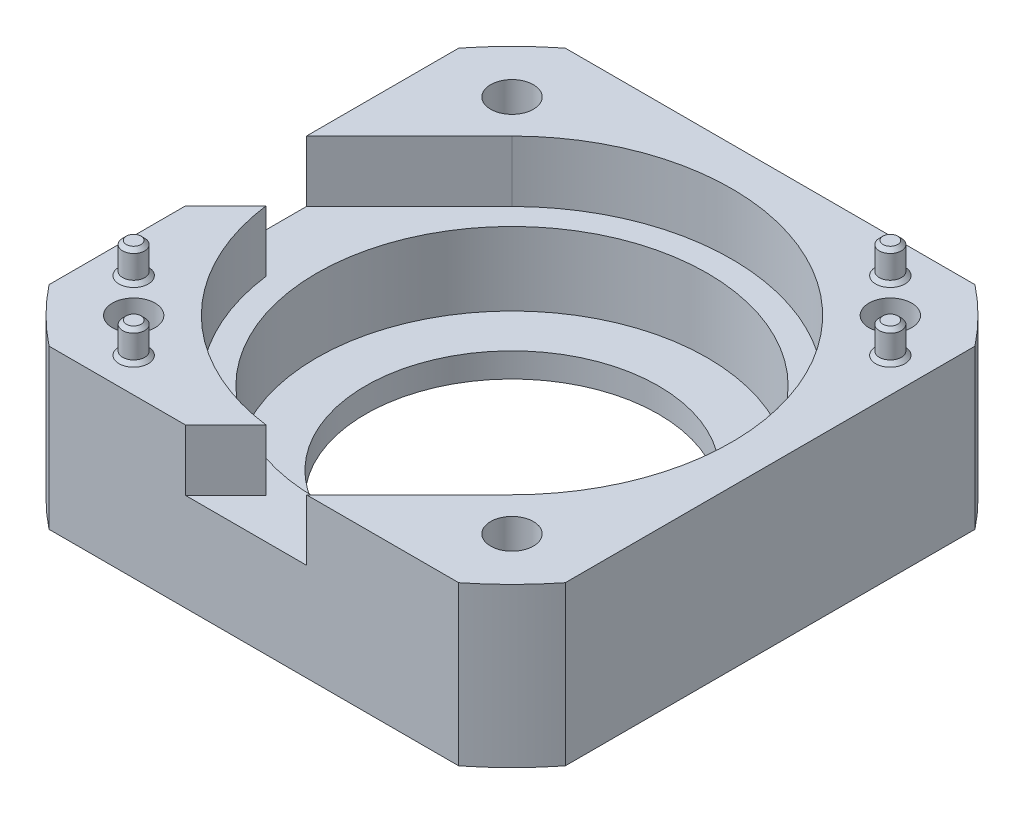
ISO-10303-21;
HEADER;
FILE_DESCRIPTION(('STEP AP214'),'2;1');
FILE_NAME('part.step','',(''),(''),'','','');
FILE_SCHEMA(('AUTOMOTIVE_DESIGN { 1 0 10303 214 1 1 1 1 }'));
ENDSEC;
DATA;
#1=APPLICATION_CONTEXT('core data for automotive mechanical design processes');
#2=APPLICATION_PROTOCOL_DEFINITION('international standard','automotive_design',2000,#1);
#3=PRODUCT_CONTEXT('',#1,'mechanical');
#4=PRODUCT('Part','Part','',(#3));
#5=PRODUCT_RELATED_PRODUCT_CATEGORY('part','',(#4));
#6=PRODUCT_DEFINITION_FORMATION('','',#4);
#7=PRODUCT_DEFINITION_CONTEXT('part definition',#1,'design');
#8=PRODUCT_DEFINITION('design','',#6,#7);
#9=PRODUCT_DEFINITION_SHAPE('','',#8);
#10=(LENGTH_UNIT() NAMED_UNIT(*) SI_UNIT(.MILLI.,.METRE.));
#11=(NAMED_UNIT(*) PLANE_ANGLE_UNIT() SI_UNIT($,.RADIAN.));
#12=(NAMED_UNIT(*) SI_UNIT($,.STERADIAN.) SOLID_ANGLE_UNIT());
#13=UNCERTAINTY_MEASURE_WITH_UNIT(LENGTH_MEASURE(1.E-05),#10,'distance_accuracy_value','');
#14=(GEOMETRIC_REPRESENTATION_CONTEXT(3) GLOBAL_UNCERTAINTY_ASSIGNED_CONTEXT((#13)) GLOBAL_UNIT_ASSIGNED_CONTEXT((#10,
#11,#12)) REPRESENTATION_CONTEXT('',''));
#15=CARTESIAN_POINT('',(0.,0.,0.));
#16=DIRECTION('',(0.,0.,1.));
#17=DIRECTION('',(1.,0.,0.));
#18=AXIS2_PLACEMENT_3D('',#15,#16,#17);
#19=CARTESIAN_POINT('',(0.,2.,0.));
#20=DIRECTION('',(0.,1.,0.));
#21=DIRECTION('',(0.,0.,1.));
#22=AXIS2_PLACEMENT_3D('',#19,#20,#21);
#23=PLANE('',#22);
#24=CARTESIAN_POINT('',(0.,2.,0.));
#25=DIRECTION('',(0.,1.,0.));
#26=DIRECTION('',(0.,0.,1.));
#27=AXIS2_PLACEMENT_3D('',#24,#25,#26);
#28=CIRCLE('',#27,12.);
#29=CARTESIAN_POINT('',(0.,2.,12.));
#30=VERTEX_POINT('',#29);
#31=EDGE_CURVE('E1005',#30,#30,#28,.T.);
#32=ORIENTED_EDGE('',*,*,#31,.F.);
#33=EDGE_LOOP('',(#32));
#34=FACE_BOUND('',#33,.T.);
#35=CARTESIAN_POINT('',(0.,2.,0.));
#36=DIRECTION('',(0.,1.,0.));
#37=DIRECTION('',(0.,0.,1.));
#38=AXIS2_PLACEMENT_3D('',#35,#36,#37);
#39=CIRCLE('',#38,16.);
#40=CARTESIAN_POINT('',(0.,2.,16.));
#41=VERTEX_POINT('',#40);
#42=EDGE_CURVE('E297',#41,#41,#39,.F.);
#43=ORIENTED_EDGE('',*,*,#42,.F.);
#44=EDGE_LOOP('',(#43));
#45=FACE_BOUND('',#44,.T.);
#46=ADVANCED_FACE('F45',(#34,#45),#23,.T.);
#47=CARTESIAN_POINT('',(0.,13.,0.));
#48=DIRECTION('',(0.,1.,0.));
#49=DIRECTION('',(0.,0.,1.));
#50=AXIS2_PLACEMENT_3D('',#47,#48,#49);
#51=PLANE('',#50);
#52=CARTESIAN_POINT('',(18.3284271247462,13.,-12.6715728752538));
#53=DIRECTION('',(0.,1.,0.));
#54=DIRECTION('',(0.,0.,1.));
#55=AXIS2_PLACEMENT_3D('',#52,#53,#54);
#56=CIRCLE('',#55,1.2);
#57=CARTESIAN_POINT('',(18.3284271247462,13.,-11.4715728752538));
#58=VERTEX_POINT('',#57);
#59=EDGE_CURVE('E341',#58,#58,#56,.F.);
#60=ORIENTED_EDGE('',*,*,#59,.T.);
#61=EDGE_LOOP('',(#60));
#62=FACE_BOUND('',#61,.T.);
#63=CARTESIAN_POINT('',(12.6715728752538,13.,-18.3284271247462));
#64=DIRECTION('',(0.,1.,0.));
#65=DIRECTION('',(0.,0.,1.));
#66=AXIS2_PLACEMENT_3D('',#63,#64,#65);
#67=CIRCLE('',#66,1.20000000000001);
#68=CARTESIAN_POINT('',(12.6715728752538,13.,-17.1284271247462));
#69=VERTEX_POINT('',#68);
#70=EDGE_CURVE('E337',#69,#69,#67,.F.);
#71=ORIENTED_EDGE('',*,*,#70,.T.);
#72=EDGE_LOOP('',(#71));
#73=FACE_BOUND('',#72,.T.);
#74=DIRECTION('',(-0.707106781186544,0.,0.707106781186551));
#75=VECTOR('',#74,1.);
#76=CARTESIAN_POINT('',(-21.15,13.,-4.30584412271561));
#77=LINE('',#76,#75);
#78=CARTESIAN_POINT('',(-12.7279220613579,13.,-12.7279220613578));
#79=VERTEX_POINT('',#78);
#80=CARTESIAN_POINT('',(-21.15,13.,-4.30584412271561));
#81=VERTEX_POINT('',#80);
#82=EDGE_CURVE('E209',#79,#81,#77,.T.);
#83=ORIENTED_EDGE('',*,*,#82,.F.);
#84=CARTESIAN_POINT('',(0.,13.,0.));
#85=DIRECTION('',(0.,1.,0.));
#86=DIRECTION('',(0.,0.,-1.));
#87=AXIS2_PLACEMENT_3D('',#84,#85,#86);
#88=CIRCLE('',#87,18.);
#89=CARTESIAN_POINT('',(12.7279220613578,13.,12.7279220613579));
#90=VERTEX_POINT('',#89);
#91=EDGE_CURVE('E183',#90,#79,#88,.T.);
#92=ORIENTED_EDGE('',*,*,#91,.F.);
#93=DIRECTION('',(0.707106781186551,0.,-0.707106781186544));
#94=VECTOR('',#93,1.);
#95=CARTESIAN_POINT('',(12.7279220613578,13.,12.7279220613579));
#96=LINE('',#95,#94);
#97=CARTESIAN_POINT('',(4.30584412271562,13.,21.15));
#98=VERTEX_POINT('',#97);
#99=EDGE_CURVE('E470',#98,#90,#96,.T.);
#100=ORIENTED_EDGE('',*,*,#99,.F.);
#101=DIRECTION('',(1.,0.,0.));
#102=VECTOR('',#101,1.);
#103=CARTESIAN_POINT('',(-21.15,13.,21.15));
#104=LINE('',#103,#102);
#105=CARTESIAN_POINT('',(16.7832505790744,13.,21.15));
#106=VERTEX_POINT('',#105);
#107=EDGE_CURVE('E273',#98,#106,#104,.T.);
#108=ORIENTED_EDGE('',*,*,#107,.T.);
#109=CARTESIAN_POINT('',(0.,13.,0.));
#110=DIRECTION('',(0.,1.,0.));
#111=DIRECTION('',(0.,0.,1.));
#112=AXIS2_PLACEMENT_3D('',#109,#110,#111);
#113=CIRCLE('',#112,27.);
#114=CARTESIAN_POINT('',(21.15,13.,16.7832505790744));
#115=VERTEX_POINT('',#114);
#116=EDGE_CURVE('E214',#106,#115,#113,.T.);
#117=ORIENTED_EDGE('',*,*,#116,.T.);
#118=DIRECTION('',(0.,0.,-1.));
#119=VECTOR('',#118,1.);
#120=CARTESIAN_POINT('',(21.15,13.,-21.15));
#121=LINE('',#120,#119);
#122=CARTESIAN_POINT('',(21.15,13.,-16.7832505790744));
#123=VERTEX_POINT('',#122);
#124=EDGE_CURVE('E259',#115,#123,#121,.T.);
#125=ORIENTED_EDGE('',*,*,#124,.T.);
#126=CARTESIAN_POINT('',(16.7832505790744,13.,-21.15));
#127=VERTEX_POINT('',#126);
#128=EDGE_CURVE('E218',#123,#127,#113,.T.);
#129=ORIENTED_EDGE('',*,*,#128,.T.);
#130=DIRECTION('',(-1.,0.,0.));
#131=VECTOR('',#130,1.);
#132=CARTESIAN_POINT('',(-21.15,13.,-21.15));
#133=LINE('',#132,#131);
#134=CARTESIAN_POINT('',(-16.7832505790744,13.,-21.15));
#135=VERTEX_POINT('',#134);
#136=EDGE_CURVE('E263',#127,#135,#133,.T.);
#137=ORIENTED_EDGE('',*,*,#136,.T.);
#138=CARTESIAN_POINT('',(-21.15,13.,-16.7832505790744));
#139=VERTEX_POINT('',#138);
#140=EDGE_CURVE('E438',#135,#139,#113,.T.);
#141=ORIENTED_EDGE('',*,*,#140,.T.);
#142=DIRECTION('',(0.,0.,1.));
#143=VECTOR('',#142,1.);
#144=CARTESIAN_POINT('',(-21.15,13.,-21.15));
#145=LINE('',#144,#143);
#146=EDGE_CURVE('E269',#139,#81,#145,.T.);
#147=ORIENTED_EDGE('',*,*,#146,.T.);
#148=EDGE_LOOP('',(#83,#92,#100,#108,#117,#125,#129,#137,#141,#147));
#149=FACE_BOUND('',#148,.T.);
#150=CARTESIAN_POINT('',(-15.5,13.,-15.5));
#151=DIRECTION('',(0.,1.,0.));
#152=DIRECTION('',(0.,0.,1.));
#153=AXIS2_PLACEMENT_3D('',#150,#151,#152);
#154=CIRCLE('',#153,1.75);
#155=CARTESIAN_POINT('',(-15.5,13.,-13.75));
#156=VERTEX_POINT('',#155);
#157=EDGE_CURVE('E247',#156,#156,#154,.T.);
#158=ORIENTED_EDGE('',*,*,#157,.F.);
#159=EDGE_LOOP('',(#158));
#160=FACE_BOUND('',#159,.T.);
#161=CARTESIAN_POINT('',(15.5,13.,-15.5));
#162=DIRECTION('',(0.,1.,0.));
#163=DIRECTION('',(0.,0.,1.));
#164=AXIS2_PLACEMENT_3D('',#161,#162,#163);
#165=CIRCLE('',#164,1.75000000000007);
#166=CARTESIAN_POINT('',(15.5,13.,-13.7499999999999));
#167=VERTEX_POINT('',#166);
#168=EDGE_CURVE('E243',#167,#167,#165,.T.);
#169=ORIENTED_EDGE('',*,*,#168,.F.);
#170=EDGE_LOOP('',(#169));
#171=FACE_BOUND('',#170,.T.);
#172=CARTESIAN_POINT('',(15.5,13.,15.5));
#173=DIRECTION('',(0.,1.,0.));
#174=DIRECTION('',(0.,0.,1.));
#175=AXIS2_PLACEMENT_3D('',#172,#173,#174);
#176=CIRCLE('',#175,1.75000000000013);
#177=CARTESIAN_POINT('',(15.5,13.,17.2500000000001));
#178=VERTEX_POINT('',#177);
#179=EDGE_CURVE('E248',#178,#178,#176,.T.);
#180=ORIENTED_EDGE('',*,*,#179,.F.);
#181=EDGE_LOOP('',(#180));
#182=FACE_BOUND('',#181,.T.);
#183=ADVANCED_FACE('F446',(#62,#73,#149,#160,#171,#182),#51,.T.);
#184=CARTESIAN_POINT('',(21.15,13.,-21.15));
#185=DIRECTION('',(-1.,0.,0.));
#186=DIRECTION('',(0.,0.,1.));
#187=AXIS2_PLACEMENT_3D('',#184,#185,#186);
#188=PLANE('',#187);
#189=DIRECTION('',(0.,1.,0.));
#190=VECTOR('',#189,1.);
#191=CARTESIAN_POINT('',(21.15,0.,16.7832505790744));
#192=LINE('',#191,#190);
#193=CARTESIAN_POINT('',(21.15,0.,16.7832505790744));
#194=VERTEX_POINT('',#193);
#195=EDGE_CURVE('E239',#194,#115,#192,.T.);
#196=ORIENTED_EDGE('',*,*,#195,.F.);
#197=DIRECTION('',(0.,0.,-1.));
#198=VECTOR('',#197,1.);
#199=CARTESIAN_POINT('',(21.15,0.,-21.15));
#200=LINE('',#199,#198);
#201=CARTESIAN_POINT('',(21.15,0.,-16.7832505790744));
#202=VERTEX_POINT('',#201);
#203=EDGE_CURVE('E258',#194,#202,#200,.T.);
#204=ORIENTED_EDGE('',*,*,#203,.T.);
#205=DIRECTION('',(0.,1.,0.));
#206=VECTOR('',#205,1.);
#207=CARTESIAN_POINT('',(21.15,0.,-16.7832505790744));
#208=LINE('',#207,#206);
#209=EDGE_CURVE('E236',#123,#202,#208,.F.);
#210=ORIENTED_EDGE('',*,*,#209,.F.);
#211=ORIENTED_EDGE('',*,*,#124,.F.);
#212=EDGE_LOOP('',(#196,#204,#210,#211));
#213=FACE_BOUND('',#212,.T.);
#214=ADVANCED_FACE('F465',(#213),#188,.F.);
#215=CARTESIAN_POINT('',(-21.15,13.,-21.15));
#216=DIRECTION('',(0.,0.,1.));
#217=DIRECTION('',(1.,0.,0.));
#218=AXIS2_PLACEMENT_3D('',#215,#216,#217);
#219=PLANE('',#218);
#220=DIRECTION('',(0.,1.,0.));
#221=VECTOR('',#220,1.);
#222=CARTESIAN_POINT('',(16.7832505790744,0.,-21.15));
#223=LINE('',#222,#221);
#224=CARTESIAN_POINT('',(16.7832505790744,0.,-21.15));
#225=VERTEX_POINT('',#224);
#226=EDGE_CURVE('E233',#225,#127,#223,.T.);
#227=ORIENTED_EDGE('',*,*,#226,.F.);
#228=DIRECTION('',(-1.,0.,0.));
#229=VECTOR('',#228,1.);
#230=CARTESIAN_POINT('',(-21.15,0.,-21.15));
#231=LINE('',#230,#229);
#232=CARTESIAN_POINT('',(-16.7832505790744,0.,-21.15));
#233=VERTEX_POINT('',#232);
#234=EDGE_CURVE('E282',#225,#233,#231,.T.);
#235=ORIENTED_EDGE('',*,*,#234,.T.);
#236=DIRECTION('',(0.,1.,0.));
#237=VECTOR('',#236,1.);
#238=CARTESIAN_POINT('',(-16.7832505790744,0.,-21.15));
#239=LINE('',#238,#237);
#240=EDGE_CURVE('E230',#135,#233,#239,.F.);
#241=ORIENTED_EDGE('',*,*,#240,.F.);
#242=ORIENTED_EDGE('',*,*,#136,.F.);
#243=EDGE_LOOP('',(#227,#235,#241,#242));
#244=FACE_BOUND('',#243,.T.);
#245=ADVANCED_FACE('F454',(#244),#219,.F.);
#246=CARTESIAN_POINT('',(-21.15,13.,-21.15));
#247=DIRECTION('',(1.,0.,0.));
#248=DIRECTION('',(0.,0.,-1.));
#249=AXIS2_PLACEMENT_3D('',#246,#247,#248);
#250=PLANE('',#249);
#251=DIRECTION('',(0.,0.,1.));
#252=VECTOR('',#251,1.);
#253=CARTESIAN_POINT('',(-21.15,8.,-4.30584412271561));
#254=LINE('',#253,#252);
#255=CARTESIAN_POINT('',(-21.15,8.,-4.30584412271561));
#256=VERTEX_POINT('',#255);
#257=CARTESIAN_POINT('',(-21.15,7.99999999999999,5.59365081389611));
#258=VERTEX_POINT('',#257);
#259=EDGE_CURVE('E62',#256,#258,#254,.T.);
#260=ORIENTED_EDGE('',*,*,#259,.F.);
#261=DIRECTION('',(0.,1.,0.));
#262=VECTOR('',#261,1.);
#263=CARTESIAN_POINT('',(-21.15,-55.3664609669067,-4.30584412271561));
#264=LINE('',#263,#262);
#265=EDGE_CURVE('E177',#256,#81,#264,.T.);
#266=ORIENTED_EDGE('',*,*,#265,.T.);
#267=ORIENTED_EDGE('',*,*,#146,.F.);
#268=DIRECTION('',(0.,1.,0.));
#269=VECTOR('',#268,1.);
#270=CARTESIAN_POINT('',(-21.15,0.,-16.7832505790744));
#271=LINE('',#270,#269);
#272=CARTESIAN_POINT('',(-21.15,0.,-16.7832505790744));
#273=VERTEX_POINT('',#272);
#274=EDGE_CURVE('E227',#273,#139,#271,.T.);
#275=ORIENTED_EDGE('',*,*,#274,.F.);
#276=DIRECTION('',(0.,0.,1.));
#277=VECTOR('',#276,1.);
#278=CARTESIAN_POINT('',(-21.15,0.,-21.15));
#279=LINE('',#278,#277);
#280=CARTESIAN_POINT('',(-21.15,0.,16.7832505790744));
#281=VERTEX_POINT('',#280);
#282=EDGE_CURVE('E286',#273,#281,#279,.T.);
#283=ORIENTED_EDGE('',*,*,#282,.T.);
#284=DIRECTION('',(0.,1.,0.));
#285=VECTOR('',#284,1.);
#286=CARTESIAN_POINT('',(-21.15,0.,16.7832505790744));
#287=LINE('',#286,#285);
#288=CARTESIAN_POINT('',(-21.15,13.,16.7832505790744));
#289=VERTEX_POINT('',#288);
#290=EDGE_CURVE('E224',#289,#281,#287,.F.);
#291=ORIENTED_EDGE('',*,*,#290,.F.);
#292=CARTESIAN_POINT('',(-21.15,13.,5.5936508138961));
#293=VERTEX_POINT('',#292);
#294=EDGE_CURVE('E268',#293,#289,#145,.T.);
#295=ORIENTED_EDGE('',*,*,#294,.F.);
#296=DIRECTION('',(0.,1.,0.));
#297=VECTOR('',#296,1.);
#298=CARTESIAN_POINT('',(-21.15,-55.3664609669067,5.59365081389611));
#299=LINE('',#298,#297);
#300=EDGE_CURVE('E69',#258,#293,#299,.T.);
#301=ORIENTED_EDGE('',*,*,#300,.F.);
#302=EDGE_LOOP('',(#260,#266,#267,#275,#283,#291,#295,#301));
#303=FACE_BOUND('',#302,.T.);
#304=ADVANCED_FACE('F512',(#303),#250,.F.);
#305=CARTESIAN_POINT('',(-21.15,13.,21.15));
#306=DIRECTION('',(0.,0.,-1.));
#307=DIRECTION('',(-1.,0.,0.));
#308=AXIS2_PLACEMENT_3D('',#305,#306,#307);
#309=PLANE('',#308);
#310=DIRECTION('',(0.,1.,0.));
#311=VECTOR('',#310,1.);
#312=CARTESIAN_POINT('',(4.30584412271562,-55.3664609669067,21.15));
#313=LINE('',#312,#311);
#314=CARTESIAN_POINT('',(4.30584412271562,8.,21.15));
#315=VERTEX_POINT('',#314);
#316=EDGE_CURVE('E192',#315,#98,#313,.T.);
#317=ORIENTED_EDGE('',*,*,#316,.F.);
#318=DIRECTION('',(1.,0.,0.));
#319=VECTOR('',#318,1.);
#320=CARTESIAN_POINT('',(-5.5936508138961,8.,21.15));
#321=LINE('',#320,#319);
#322=CARTESIAN_POINT('',(-5.5936508138961,8.,21.15));
#323=VERTEX_POINT('',#322);
#324=EDGE_CURVE('E473',#323,#315,#321,.T.);
#325=ORIENTED_EDGE('',*,*,#324,.F.);
#326=DIRECTION('',(0.,1.,0.));
#327=VECTOR('',#326,1.);
#328=CARTESIAN_POINT('',(-5.5936508138961,-55.3664609669067,21.15));
#329=LINE('',#328,#327);
#330=CARTESIAN_POINT('',(-5.5936508138961,13.,21.15));
#331=VERTEX_POINT('',#330);
#332=EDGE_CURVE('E198',#323,#331,#329,.T.);
#333=ORIENTED_EDGE('',*,*,#332,.T.);
#334=CARTESIAN_POINT('',(-16.7832505790744,13.,21.15));
#335=VERTEX_POINT('',#334);
#336=EDGE_CURVE('E274',#335,#331,#104,.T.);
#337=ORIENTED_EDGE('',*,*,#336,.F.);
#338=DIRECTION('',(0.,1.,0.));
#339=VECTOR('',#338,1.);
#340=CARTESIAN_POINT('',(-16.7832505790744,0.,21.15));
#341=LINE('',#340,#339);
#342=CARTESIAN_POINT('',(-16.7832505790744,0.,21.15));
#343=VERTEX_POINT('',#342);
#344=EDGE_CURVE('E221',#343,#335,#341,.T.);
#345=ORIENTED_EDGE('',*,*,#344,.F.);
#346=DIRECTION('',(1.,0.,0.));
#347=VECTOR('',#346,1.);
#348=CARTESIAN_POINT('',(-21.15,0.,21.15));
#349=LINE('',#348,#347);
#350=CARTESIAN_POINT('',(16.7832505790744,0.,21.15));
#351=VERTEX_POINT('',#350);
#352=EDGE_CURVE('E264',#343,#351,#349,.T.);
#353=ORIENTED_EDGE('',*,*,#352,.T.);
#354=DIRECTION('',(0.,1.,0.));
#355=VECTOR('',#354,1.);
#356=CARTESIAN_POINT('',(16.7832505790744,0.,21.15));
#357=LINE('',#356,#355);
#358=EDGE_CURVE('E213',#106,#351,#357,.F.);
#359=ORIENTED_EDGE('',*,*,#358,.F.);
#360=ORIENTED_EDGE('',*,*,#107,.F.);
#361=EDGE_LOOP('',(#317,#325,#333,#337,#345,#353,#359,#360));
#362=FACE_BOUND('',#361,.T.);
#363=ADVANCED_FACE('F425',(#362),#309,.F.);
#364=CARTESIAN_POINT('',(-18.3284271247462,13.,12.6715728752538));
#365=DIRECTION('',(0.,1.,0.));
#366=DIRECTION('',(0.,0.,1.));
#367=AXIS2_PLACEMENT_3D('',#364,#365,#366);
#368=CIRCLE('',#367,1.2);
#369=CARTESIAN_POINT('',(-18.3284271247462,13.,13.8715728752538));
#370=VERTEX_POINT('',#369);
#371=EDGE_CURVE('E357',#370,#370,#368,.F.);
#372=ORIENTED_EDGE('',*,*,#371,.T.);
#373=EDGE_LOOP('',(#372));
#374=FACE_BOUND('',#373,.T.);
#375=CARTESIAN_POINT('',(-12.6715728752538,13.,18.3284271247462));
#376=DIRECTION('',(0.,1.,0.));
#377=DIRECTION('',(0.,0.,1.));
#378=AXIS2_PLACEMENT_3D('',#375,#376,#377);
#379=CIRCLE('',#378,1.2);
#380=CARTESIAN_POINT('',(-12.6715728752538,13.,19.5284271247462));
#381=VERTEX_POINT('',#380);
#382=EDGE_CURVE('E353',#381,#381,#379,.F.);
#383=ORIENTED_EDGE('',*,*,#382,.T.);
#384=EDGE_LOOP('',(#383));
#385=FACE_BOUND('',#384,.T.);
#386=DIRECTION('',(-0.707106781186551,0.,0.707106781186544));
#387=VECTOR('',#386,1.);
#388=CARTESIAN_POINT('',(-2.29654624675301,13.,17.852895432857));
#389=LINE('',#388,#387);
#390=CARTESIAN_POINT('',(-2.29654624675301,13.,17.852895432857));
#391=VERTEX_POINT('',#390);
#392=EDGE_CURVE('E503',#391,#331,#389,.T.);
#393=ORIENTED_EDGE('',*,*,#392,.F.);
#394=CARTESIAN_POINT('',(0.,13.,0.));
#395=DIRECTION('',(0.,1.,0.));
#396=DIRECTION('',(0.,0.,1.));
#397=AXIS2_PLACEMENT_3D('',#394,#395,#396);
#398=CIRCLE('',#397,18.);
#399=CARTESIAN_POINT('',(-17.852895432857,13.,2.29654624675301));
#400=VERTEX_POINT('',#399);
#401=EDGE_CURVE('E499',#400,#391,#398,.T.);
#402=ORIENTED_EDGE('',*,*,#401,.F.);
#403=DIRECTION('',(0.707106781186544,0.,-0.707106781186551));
#404=VECTOR('',#403,1.);
#405=CARTESIAN_POINT('',(-17.852895432857,13.,2.29654624675302));
#406=LINE('',#405,#404);
#407=EDGE_CURVE('E179',#293,#400,#406,.T.);
#408=ORIENTED_EDGE('',*,*,#407,.F.);
#409=ORIENTED_EDGE('',*,*,#294,.T.);
#410=EDGE_CURVE('E190',#289,#335,#113,.T.);
#411=ORIENTED_EDGE('',*,*,#410,.T.);
#412=ORIENTED_EDGE('',*,*,#336,.T.);
#413=EDGE_LOOP('',(#393,#402,#408,#409,#411,#412));
#414=FACE_BOUND('',#413,.T.);
#415=CARTESIAN_POINT('',(-15.5,13.,15.5));
#416=DIRECTION('',(0.,1.,0.));
#417=DIRECTION('',(0.,0.,1.));
#418=AXIS2_PLACEMENT_3D('',#415,#416,#417);
#419=CIRCLE('',#418,1.75000000000021);
#420=CARTESIAN_POINT('',(-15.5,13.,17.2500000000002));
#421=VERTEX_POINT('',#420);
#422=EDGE_CURVE('E242',#421,#421,#419,.T.);
#423=ORIENTED_EDGE('',*,*,#422,.F.);
#424=EDGE_LOOP('',(#423));
#425=FACE_BOUND('',#424,.T.);
#426=ADVANCED_FACE('F405',(#374,#385,#414,#425),#51,.T.);
#427=CARTESIAN_POINT('',(0.,0.,0.));
#428=DIRECTION('',(0.,1.,0.));
#429=DIRECTION('',(0.,0.,1.));
#430=AXIS2_PLACEMENT_3D('',#427,#428,#429);
#431=PLANE('',#430);
#432=CARTESIAN_POINT('',(-15.5,0.,-15.5));
#433=DIRECTION('',(0.,1.,0.));
#434=DIRECTION('',(0.,0.,1.));
#435=AXIS2_PLACEMENT_3D('',#432,#433,#434);
#436=CIRCLE('',#435,2.24999999999995);
#437=CARTESIAN_POINT('',(-15.5,0.,-13.25));
#438=VERTEX_POINT('',#437);
#439=EDGE_CURVE('E377',#438,#438,#436,.T.);
#440=ORIENTED_EDGE('',*,*,#439,.T.);
#441=EDGE_LOOP('',(#440));
#442=FACE_BOUND('',#441,.T.);
#443=CARTESIAN_POINT('',(15.5,0.,-15.5));
#444=DIRECTION('',(0.,1.,0.));
#445=DIRECTION('',(0.,0.,1.));
#446=AXIS2_PLACEMENT_3D('',#443,#444,#445);
#447=CIRCLE('',#446,2.25000000000002);
#448=CARTESIAN_POINT('',(15.5,0.,-13.25));
#449=VERTEX_POINT('',#448);
#450=EDGE_CURVE('E373',#449,#449,#447,.T.);
#451=ORIENTED_EDGE('',*,*,#450,.T.);
#452=EDGE_LOOP('',(#451));
#453=FACE_BOUND('',#452,.T.);
#454=CARTESIAN_POINT('',(-15.5,0.,15.5));
#455=DIRECTION('',(0.,1.,0.));
#456=DIRECTION('',(0.,0.,1.));
#457=AXIS2_PLACEMENT_3D('',#454,#455,#456);
#458=CIRCLE('',#457,2.25000000000015);
#459=CARTESIAN_POINT('',(-15.5,0.,17.7500000000002));
#460=VERTEX_POINT('',#459);
#461=EDGE_CURVE('E369',#460,#460,#458,.T.);
#462=ORIENTED_EDGE('',*,*,#461,.T.);
#463=EDGE_LOOP('',(#462));
#464=FACE_BOUND('',#463,.T.);
#465=CARTESIAN_POINT('',(15.5,0.,15.5));
#466=DIRECTION('',(0.,1.,0.));
#467=DIRECTION('',(0.,0.,1.));
#468=AXIS2_PLACEMENT_3D('',#465,#466,#467);
#469=CIRCLE('',#468,2.25000000000009);
#470=CARTESIAN_POINT('',(15.5,0.,17.7500000000001));
#471=VERTEX_POINT('',#470);
#472=EDGE_CURVE('E365',#471,#471,#469,.T.);
#473=ORIENTED_EDGE('',*,*,#472,.T.);
#474=EDGE_LOOP('',(#473));
#475=FACE_BOUND('',#474,.T.);
#476=CARTESIAN_POINT('',(0.,0.,0.));
#477=DIRECTION('',(0.,1.,0.));
#478=DIRECTION('',(0.,0.,1.));
#479=AXIS2_PLACEMENT_3D('',#476,#477,#478);
#480=CIRCLE('',#479,12.);
#481=CARTESIAN_POINT('',(0.,0.,12.));
#482=VERTEX_POINT('',#481);
#483=EDGE_CURVE('E413',#482,#482,#480,.T.);
#484=ORIENTED_EDGE('',*,*,#483,.T.);
#485=EDGE_LOOP('',(#484));
#486=FACE_BOUND('',#485,.T.);
#487=CARTESIAN_POINT('',(0.,0.,0.));
#488=DIRECTION('',(0.,1.,0.));
#489=DIRECTION('',(0.,0.,1.));
#490=AXIS2_PLACEMENT_3D('',#487,#488,#489);
#491=CIRCLE('',#490,27.);
#492=EDGE_CURVE('E210',#351,#194,#491,.T.);
#493=ORIENTED_EDGE('',*,*,#492,.F.);
#494=ORIENTED_EDGE('',*,*,#352,.F.);
#495=CARTESIAN_POINT('',(0.,0.,0.));
#496=DIRECTION('',(0.,1.,0.));
#497=DIRECTION('',(0.,0.,1.));
#498=AXIS2_PLACEMENT_3D('',#495,#496,#497);
#499=CIRCLE('',#498,27.);
#500=EDGE_CURVE('E278',#281,#343,#499,.T.);
#501=ORIENTED_EDGE('',*,*,#500,.F.);
#502=ORIENTED_EDGE('',*,*,#282,.F.);
#503=EDGE_CURVE('E295',#233,#273,#499,.T.);
#504=ORIENTED_EDGE('',*,*,#503,.F.);
#505=ORIENTED_EDGE('',*,*,#234,.F.);
#506=EDGE_CURVE('E296',#202,#225,#499,.T.);
#507=ORIENTED_EDGE('',*,*,#506,.F.);
#508=ORIENTED_EDGE('',*,*,#203,.F.);
#509=EDGE_LOOP('',(#493,#494,#501,#502,#504,#505,#507,#508));
#510=FACE_BOUND('',#509,.T.);
#511=ADVANCED_FACE('F401',(#442,#453,#464,#475,#486,#510),#431,.F.);
#512=CARTESIAN_POINT('',(-15.5,0.,-15.5));
#513=DIRECTION('',(0.,1.,0.));
#514=DIRECTION('',(0.,0.,1.));
#515=AXIS2_PLACEMENT_3D('',#512,#513,#514);
#516=CYLINDRICAL_SURFACE('',#515,1.75);
#517=CARTESIAN_POINT('',(-15.5,0.499999999999956,-15.5));
#518=DIRECTION('',(0.,1.,0.));
#519=DIRECTION('',(0.,0.,1.));
#520=AXIS2_PLACEMENT_3D('',#517,#518,#519);
#521=CIRCLE('',#520,1.75);
#522=CARTESIAN_POINT('',(-15.5,0.499999999999956,-13.75));
#523=VERTEX_POINT('',#522);
#524=EDGE_CURVE('E381',#523,#523,#521,.F.);
#525=ORIENTED_EDGE('',*,*,#524,.T.);
#526=EDGE_LOOP('',(#525));
#527=FACE_BOUND('',#526,.T.);
#528=ORIENTED_EDGE('',*,*,#157,.T.);
#529=EDGE_LOOP('',(#528));
#530=FACE_BOUND('',#529,.T.);
#531=ADVANCED_FACE('F404',(#527,#530),#516,.F.);
#532=CARTESIAN_POINT('',(15.5,0.,-15.5));
#533=DIRECTION('',(0.,1.,0.));
#534=DIRECTION('',(0.,0.,1.));
#535=AXIS2_PLACEMENT_3D('',#532,#533,#534);
#536=CYLINDRICAL_SURFACE('',#535,1.75000000000007);
#537=CARTESIAN_POINT('',(15.5,0.499999999999959,-15.5));
#538=DIRECTION('',(0.,1.,0.));
#539=DIRECTION('',(0.,0.,1.));
#540=AXIS2_PLACEMENT_3D('',#537,#538,#539);
#541=CIRCLE('',#540,1.75000000000007);
#542=CARTESIAN_POINT('',(15.5,0.499999999999959,-13.7499999999999));
#543=VERTEX_POINT('',#542);
#544=EDGE_CURVE('E385',#543,#543,#541,.F.);
#545=ORIENTED_EDGE('',*,*,#544,.T.);
#546=EDGE_LOOP('',(#545));
#547=FACE_BOUND('',#546,.T.);
#548=ORIENTED_EDGE('',*,*,#168,.T.);
#549=EDGE_LOOP('',(#548));
#550=FACE_BOUND('',#549,.T.);
#551=ADVANCED_FACE('F554',(#547,#550),#536,.F.);
#552=CARTESIAN_POINT('',(15.5,0.,15.5));
#553=DIRECTION('',(0.,1.,0.));
#554=DIRECTION('',(0.,0.,1.));
#555=AXIS2_PLACEMENT_3D('',#552,#553,#554);
#556=CYLINDRICAL_SURFACE('',#555,1.75000000000013);
#557=CARTESIAN_POINT('',(15.5,0.499999999999961,15.5));
#558=DIRECTION('',(0.,1.,0.));
#559=DIRECTION('',(0.,0.,1.));
#560=AXIS2_PLACEMENT_3D('',#557,#558,#559);
#561=CIRCLE('',#560,1.75000000000013);
#562=CARTESIAN_POINT('',(15.5,0.499999999999961,17.2500000000001));
#563=VERTEX_POINT('',#562);
#564=EDGE_CURVE('E12',#563,#563,#561,.F.);
#565=ORIENTED_EDGE('',*,*,#564,.T.);
#566=EDGE_LOOP('',(#565));
#567=FACE_BOUND('',#566,.T.);
#568=ORIENTED_EDGE('',*,*,#179,.T.);
#569=EDGE_LOOP('',(#568));
#570=FACE_BOUND('',#569,.T.);
#571=ADVANCED_FACE('F557',(#567,#570),#556,.F.);
#572=CARTESIAN_POINT('',(-15.5,0.,15.5));
#573=DIRECTION('',(0.,1.,0.));
#574=DIRECTION('',(0.,0.,1.));
#575=AXIS2_PLACEMENT_3D('',#572,#573,#574);
#576=CYLINDRICAL_SURFACE('',#575,1.75000000000021);
#577=CARTESIAN_POINT('',(-15.5,0.499999999999947,15.5));
#578=DIRECTION('',(0.,1.,0.));
#579=DIRECTION('',(0.,0.,1.));
#580=AXIS2_PLACEMENT_3D('',#577,#578,#579);
#581=CIRCLE('',#580,1.75000000000021);
#582=CARTESIAN_POINT('',(-15.5,0.499999999999947,17.2500000000002));
#583=VERTEX_POINT('',#582);
#584=EDGE_CURVE('E55',#583,#583,#581,.F.);
#585=ORIENTED_EDGE('',*,*,#584,.T.);
#586=EDGE_LOOP('',(#585));
#587=FACE_BOUND('',#586,.T.);
#588=ORIENTED_EDGE('',*,*,#422,.T.);
#589=EDGE_LOOP('',(#588));
#590=FACE_BOUND('',#589,.T.);
#591=ADVANCED_FACE('F392',(#587,#590),#576,.F.);
#592=CARTESIAN_POINT('',(0.,0.,0.));
#593=DIRECTION('',(0.,1.,0.));
#594=DIRECTION('',(0.,0.,1.));
#595=AXIS2_PLACEMENT_3D('',#592,#593,#594);
#596=CYLINDRICAL_SURFACE('',#595,27.);
#597=ORIENTED_EDGE('',*,*,#290,.T.);
#598=ORIENTED_EDGE('',*,*,#500,.T.);
#599=ORIENTED_EDGE('',*,*,#344,.T.);
#600=ORIENTED_EDGE('',*,*,#410,.F.);
#601=EDGE_LOOP('',(#597,#598,#599,#600));
#602=FACE_BOUND('',#601,.T.);
#603=ADVANCED_FACE('F431',(#602),#596,.T.);
#604=ORIENTED_EDGE('',*,*,#240,.T.);
#605=ORIENTED_EDGE('',*,*,#503,.T.);
#606=ORIENTED_EDGE('',*,*,#274,.T.);
#607=ORIENTED_EDGE('',*,*,#140,.F.);
#608=EDGE_LOOP('',(#604,#605,#606,#607));
#609=FACE_BOUND('',#608,.T.);
#610=ADVANCED_FACE('F458',(#609),#596,.T.);
#611=ORIENTED_EDGE('',*,*,#209,.T.);
#612=ORIENTED_EDGE('',*,*,#506,.T.);
#613=ORIENTED_EDGE('',*,*,#226,.T.);
#614=ORIENTED_EDGE('',*,*,#128,.F.);
#615=EDGE_LOOP('',(#611,#612,#613,#614));
#616=FACE_BOUND('',#615,.T.);
#617=ADVANCED_FACE('F463',(#616),#596,.T.);
#618=ORIENTED_EDGE('',*,*,#195,.T.);
#619=ORIENTED_EDGE('',*,*,#116,.F.);
#620=ORIENTED_EDGE('',*,*,#358,.T.);
#621=ORIENTED_EDGE('',*,*,#492,.T.);
#622=EDGE_LOOP('',(#618,#619,#620,#621));
#623=FACE_BOUND('',#622,.T.);
#624=ADVANCED_FACE('F467',(#623),#596,.T.);
#625=CARTESIAN_POINT('',(-21.15,-55.3664609669067,-4.30584412271561));
#626=DIRECTION('',(-0.707106781186551,0.,-0.707106781186544));
#627=DIRECTION('',(-0.707106781186544,0.,0.707106781186551));
#628=AXIS2_PLACEMENT_3D('',#625,#626,#627);
#629=PLANE('',#628);
#630=ORIENTED_EDGE('',*,*,#265,.F.);
#631=DIRECTION('',(-0.707106781186544,0.,0.707106781186551));
#632=VECTOR('',#631,1.);
#633=CARTESIAN_POINT('',(-12.7279220613579,8.,-12.7279220613578));
#634=LINE('',#633,#632);
#635=CARTESIAN_POINT('',(-12.7279220613579,8.,-12.7279220613578));
#636=VERTEX_POINT('',#635);
#637=EDGE_CURVE('E162',#636,#256,#634,.T.);
#638=ORIENTED_EDGE('',*,*,#637,.F.);
#639=DIRECTION('',(0.,1.,0.));
#640=VECTOR('',#639,1.);
#641=CARTESIAN_POINT('',(-12.7279220613579,-55.3664609669067,-12.7279220613578));
#642=LINE('',#641,#640);
#643=EDGE_CURVE('E175',#636,#79,#642,.T.);
#644=ORIENTED_EDGE('',*,*,#643,.T.);
#645=ORIENTED_EDGE('',*,*,#82,.T.);
#646=EDGE_LOOP('',(#630,#638,#644,#645));
#647=FACE_BOUND('',#646,.T.);
#648=ADVANCED_FACE('F173',(#647),#629,.F.);
#649=CARTESIAN_POINT('',(0.,-55.3664609669067,0.));
#650=DIRECTION('',(0.,1.,0.));
#651=DIRECTION('',(0.,0.,1.));
#652=AXIS2_PLACEMENT_3D('',#649,#650,#651);
#653=CYLINDRICAL_SURFACE('',#652,18.);
#654=ORIENTED_EDGE('',*,*,#643,.F.);
#655=CARTESIAN_POINT('',(0.,8.,0.));
#656=DIRECTION('',(0.,1.,0.));
#657=DIRECTION('',(0.,0.,1.));
#658=AXIS2_PLACEMENT_3D('',#655,#656,#657);
#659=CIRCLE('',#658,18.);
#660=CARTESIAN_POINT('',(12.7279220613578,8.,12.7279220613579));
#661=VERTEX_POINT('',#660);
#662=EDGE_CURVE('E159',#661,#636,#659,.T.);
#663=ORIENTED_EDGE('',*,*,#662,.F.);
#664=DIRECTION('',(0.,1.,0.));
#665=VECTOR('',#664,1.);
#666=CARTESIAN_POINT('',(12.7279220613578,-55.3664609669067,12.7279220613579));
#667=LINE('',#666,#665);
#668=EDGE_CURVE('E186',#661,#90,#667,.T.);
#669=ORIENTED_EDGE('',*,*,#668,.T.);
#670=ORIENTED_EDGE('',*,*,#91,.T.);
#671=EDGE_LOOP('',(#654,#663,#669,#670));
#672=FACE_BOUND('',#671,.T.);
#673=ADVANCED_FACE('F181',(#672),#653,.F.);
#674=CARTESIAN_POINT('',(12.7279220613578,-55.3664609669067,12.7279220613579));
#675=DIRECTION('',(0.707106781186544,0.,0.707106781186551));
#676=DIRECTION('',(0.707106781186551,0.,-0.707106781186544));
#677=AXIS2_PLACEMENT_3D('',#674,#675,#676);
#678=PLANE('',#677);
#679=ORIENTED_EDGE('',*,*,#668,.F.);
#680=DIRECTION('',(0.707106781186551,0.,-0.707106781186544));
#681=VECTOR('',#680,1.);
#682=CARTESIAN_POINT('',(4.30584412271562,8.,21.15));
#683=LINE('',#682,#681);
#684=EDGE_CURVE('E165',#315,#661,#683,.T.);
#685=ORIENTED_EDGE('',*,*,#684,.F.);
#686=ORIENTED_EDGE('',*,*,#316,.T.);
#687=ORIENTED_EDGE('',*,*,#99,.T.);
#688=EDGE_LOOP('',(#679,#685,#686,#687));
#689=FACE_BOUND('',#688,.T.);
#690=ADVANCED_FACE('F476',(#689),#678,.F.);
#691=CARTESIAN_POINT('',(-2.29654624675301,-55.3664609669067,17.852895432857));
#692=DIRECTION('',(-0.707106781186544,0.,-0.707106781186551));
#693=DIRECTION('',(-0.707106781186551,0.,0.707106781186544));
#694=AXIS2_PLACEMENT_3D('',#691,#692,#693);
#695=PLANE('',#694);
#696=ORIENTED_EDGE('',*,*,#332,.F.);
#697=DIRECTION('',(-0.70710678118655,0.,0.707106781186545));
#698=VECTOR('',#697,1.);
#699=CARTESIAN_POINT('',(-2.29654624675302,8.,17.852895432857));
#700=LINE('',#699,#698);
#701=CARTESIAN_POINT('',(-2.29654624675302,8.,17.852895432857));
#702=VERTEX_POINT('',#701);
#703=EDGE_CURVE('E480',#702,#323,#700,.T.);
#704=ORIENTED_EDGE('',*,*,#703,.F.);
#705=DIRECTION('',(0.,1.,0.));
#706=VECTOR('',#705,1.);
#707=CARTESIAN_POINT('',(-2.29654624675301,-55.3664609669067,17.852895432857));
#708=LINE('',#707,#706);
#709=EDGE_CURVE('E201',#702,#391,#708,.T.);
#710=ORIENTED_EDGE('',*,*,#709,.T.);
#711=ORIENTED_EDGE('',*,*,#392,.T.);
#712=EDGE_LOOP('',(#696,#704,#710,#711));
#713=FACE_BOUND('',#712,.T.);
#714=ADVANCED_FACE('F541',(#713),#695,.F.);
#715=CARTESIAN_POINT('',(0.,-55.3664609669067,0.));
#716=DIRECTION('',(0.,1.,0.));
#717=DIRECTION('',(0.,0.,1.));
#718=AXIS2_PLACEMENT_3D('',#715,#716,#717);
#719=CYLINDRICAL_SURFACE('',#718,18.);
#720=ORIENTED_EDGE('',*,*,#709,.F.);
#721=CARTESIAN_POINT('',(0.,8.,0.));
#722=DIRECTION('',(0.,1.,0.));
#723=DIRECTION('',(0.,0.,1.));
#724=AXIS2_PLACEMENT_3D('',#721,#722,#723);
#725=CIRCLE('',#724,18.);
#726=CARTESIAN_POINT('',(-17.852895432857,8.,2.29654624675301));
#727=VERTEX_POINT('',#726);
#728=EDGE_CURVE('E486',#727,#702,#725,.T.);
#729=ORIENTED_EDGE('',*,*,#728,.F.);
#730=DIRECTION('',(0.,1.,0.));
#731=VECTOR('',#730,1.);
#732=CARTESIAN_POINT('',(-17.852895432857,-55.3664609669067,2.29654624675301));
#733=LINE('',#732,#731);
#734=EDGE_CURVE('E204',#727,#400,#733,.T.);
#735=ORIENTED_EDGE('',*,*,#734,.T.);
#736=ORIENTED_EDGE('',*,*,#401,.T.);
#737=EDGE_LOOP('',(#720,#729,#735,#736));
#738=FACE_BOUND('',#737,.T.);
#739=ADVANCED_FACE('F544',(#738),#719,.F.);
#740=CARTESIAN_POINT('',(-17.852895432857,-55.3664609669067,2.29654624675302));
#741=DIRECTION('',(0.707106781186551,0.,0.707106781186544));
#742=DIRECTION('',(0.707106781186544,0.,-0.707106781186551));
#743=AXIS2_PLACEMENT_3D('',#740,#741,#742);
#744=PLANE('',#743);
#745=ORIENTED_EDGE('',*,*,#734,.F.);
#746=DIRECTION('',(0.707106781186542,0.,-0.707106781186553));
#747=VECTOR('',#746,1.);
#748=CARTESIAN_POINT('',(-21.15,8.,5.59365081389611));
#749=LINE('',#748,#747);
#750=EDGE_CURVE('E489',#258,#727,#749,.T.);
#751=ORIENTED_EDGE('',*,*,#750,.F.);
#752=ORIENTED_EDGE('',*,*,#300,.T.);
#753=ORIENTED_EDGE('',*,*,#407,.T.);
#754=EDGE_LOOP('',(#745,#751,#752,#753));
#755=FACE_BOUND('',#754,.T.);
#756=ADVANCED_FACE('F548',(#755),#744,.F.);
#757=CARTESIAN_POINT('',(0.,68.3664609669067,0.));
#758=DIRECTION('',(0.,-1.,0.));
#759=DIRECTION('',(0.,0.,-1.));
#760=AXIS2_PLACEMENT_3D('',#757,#758,#759);
#761=CYLINDRICAL_SURFACE('',#760,16.);
#762=ORIENTED_EDGE('',*,*,#42,.T.);
#763=EDGE_LOOP('',(#762));
#764=FACE_BOUND('',#763,.T.);
#765=CARTESIAN_POINT('',(0.,8.,0.));
#766=DIRECTION('',(0.,1.,0.));
#767=DIRECTION('',(0.,0.,1.));
#768=AXIS2_PLACEMENT_3D('',#765,#766,#767);
#769=CIRCLE('',#768,16.);
#770=CARTESIAN_POINT('',(0.,8.,16.));
#771=VERTEX_POINT('',#770);
#772=EDGE_CURVE('E170',#771,#771,#769,.T.);
#773=ORIENTED_EDGE('',*,*,#772,.T.);
#774=EDGE_LOOP('',(#773));
#775=FACE_BOUND('',#774,.T.);
#776=ADVANCED_FACE('F533',(#764,#775),#761,.F.);
#777=CARTESIAN_POINT('',(0.,8.,0.));
#778=DIRECTION('',(0.,1.,0.));
#779=DIRECTION('',(0.,0.,1.));
#780=AXIS2_PLACEMENT_3D('',#777,#778,#779);
#781=PLANE('',#780);
#782=ORIENTED_EDGE('',*,*,#772,.F.);
#783=EDGE_LOOP('',(#782));
#784=FACE_BOUND('',#783,.T.);
#785=ORIENTED_EDGE('',*,*,#662,.T.);
#786=ORIENTED_EDGE('',*,*,#637,.T.);
#787=ORIENTED_EDGE('',*,*,#259,.T.);
#788=ORIENTED_EDGE('',*,*,#750,.T.);
#789=ORIENTED_EDGE('',*,*,#728,.T.);
#790=ORIENTED_EDGE('',*,*,#703,.T.);
#791=ORIENTED_EDGE('',*,*,#324,.T.);
#792=ORIENTED_EDGE('',*,*,#684,.T.);
#793=EDGE_LOOP('',(#785,#786,#787,#788,#789,#790,#791,#792));
#794=FACE_BOUND('',#793,.T.);
#795=ADVANCED_FACE('F161',(#784,#794),#781,.T.);
#796=CARTESIAN_POINT('',(12.6715728752538,15.5,-18.3284271247462));
#797=DIRECTION('',(0.,-1.,0.));
#798=DIRECTION('',(0.,0.,-1.));
#799=AXIS2_PLACEMENT_3D('',#796,#797,#798);
#800=CYLINDRICAL_SURFACE('',#799,0.900000000000004);
#801=CARTESIAN_POINT('',(12.6715728752538,13.3,-18.3284271247462));
#802=DIRECTION('',(0.,1.,0.));
#803=DIRECTION('',(0.,0.,1.));
#804=AXIS2_PLACEMENT_3D('',#801,#802,#803);
#805=CIRCLE('',#804,0.900000000000004);
#806=CARTESIAN_POINT('',(12.6715728752538,13.3,-17.4284271247462));
#807=VERTEX_POINT('',#806);
#808=EDGE_CURVE('E345',#807,#807,#805,.T.);
#809=ORIENTED_EDGE('',*,*,#808,.T.);
#810=EDGE_LOOP('',(#809));
#811=FACE_BOUND('',#810,.T.);
#812=CARTESIAN_POINT('',(12.6715728752538,15.2,-18.3284271247462));
#813=DIRECTION('',(0.,1.,0.));
#814=DIRECTION('',(0.,0.,1.));
#815=AXIS2_PLACEMENT_3D('',#812,#813,#814);
#816=CIRCLE('',#815,0.900000000000004);
#817=CARTESIAN_POINT('',(12.6715728752538,15.2,-17.4284271247462));
#818=VERTEX_POINT('',#817);
#819=EDGE_CURVE('E313',#818,#818,#816,.F.);
#820=ORIENTED_EDGE('',*,*,#819,.T.);
#821=EDGE_LOOP('',(#820));
#822=FACE_BOUND('',#821,.T.);
#823=ADVANCED_FACE('F619',(#811,#822),#800,.T.);
#824=CARTESIAN_POINT('',(12.6715728752538,15.5,-18.3284271247462));
#825=DIRECTION('',(0.,1.,0.));
#826=DIRECTION('',(0.,0.,1.));
#827=AXIS2_PLACEMENT_3D('',#824,#825,#826);
#828=PLANE('',#827);
#829=CARTESIAN_POINT('',(12.6715728752538,15.5,-18.3284271247462));
#830=DIRECTION('',(0.,1.,0.));
#831=DIRECTION('',(0.,0.,1.));
#832=AXIS2_PLACEMENT_3D('',#829,#830,#831);
#833=CIRCLE('',#832,0.599999999999989);
#834=CARTESIAN_POINT('',(12.6715728752538,15.5,-17.7284271247462));
#835=VERTEX_POINT('',#834);
#836=EDGE_CURVE('E309',#835,#835,#833,.T.);
#837=ORIENTED_EDGE('',*,*,#836,.T.);
#838=EDGE_LOOP('',(#837));
#839=FACE_BOUND('',#838,.T.);
#840=ADVANCED_FACE('F615',(#839),#828,.T.);
#841=CARTESIAN_POINT('',(18.3284271247462,15.5,-12.6715728752538));
#842=DIRECTION('',(0.,-1.,0.));
#843=DIRECTION('',(0.,0.,-1.));
#844=AXIS2_PLACEMENT_3D('',#841,#842,#843);
#845=CYLINDRICAL_SURFACE('',#844,0.9);
#846=CARTESIAN_POINT('',(18.3284271247462,13.3,-12.6715728752538));
#847=DIRECTION('',(0.,1.,0.));
#848=DIRECTION('',(0.,0.,1.));
#849=AXIS2_PLACEMENT_3D('',#846,#847,#848);
#850=CIRCLE('',#849,0.9);
#851=CARTESIAN_POINT('',(18.3284271247462,13.3,-11.7715728752538));
#852=VERTEX_POINT('',#851);
#853=EDGE_CURVE('E333',#852,#852,#850,.T.);
#854=ORIENTED_EDGE('',*,*,#853,.T.);
#855=EDGE_LOOP('',(#854));
#856=FACE_BOUND('',#855,.T.);
#857=CARTESIAN_POINT('',(18.3284271247462,15.2,-12.6715728752538));
#858=DIRECTION('',(0.,1.,0.));
#859=DIRECTION('',(0.,0.,1.));
#860=AXIS2_PLACEMENT_3D('',#857,#858,#859);
#861=CIRCLE('',#860,0.9);
#862=CARTESIAN_POINT('',(18.3284271247462,15.2,-11.7715728752538));
#863=VERTEX_POINT('',#862);
#864=EDGE_CURVE('E305',#863,#863,#861,.F.);
#865=ORIENTED_EDGE('',*,*,#864,.T.);
#866=EDGE_LOOP('',(#865));
#867=FACE_BOUND('',#866,.T.);
#868=ADVANCED_FACE('F611',(#856,#867),#845,.T.);
#869=CARTESIAN_POINT('',(18.3284271247462,15.5,-12.6715728752538));
#870=DIRECTION('',(0.,1.,0.));
#871=DIRECTION('',(0.,0.,1.));
#872=AXIS2_PLACEMENT_3D('',#869,#870,#871);
#873=PLANE('',#872);
#874=CARTESIAN_POINT('',(18.3284271247462,15.5,-12.6715728752538));
#875=DIRECTION('',(0.,1.,0.));
#876=DIRECTION('',(0.,0.,1.));
#877=AXIS2_PLACEMENT_3D('',#874,#875,#876);
#878=CIRCLE('',#877,0.600000000000003);
#879=CARTESIAN_POINT('',(18.3284271247462,15.5,-12.0715728752538));
#880=VERTEX_POINT('',#879);
#881=EDGE_CURVE('E301',#880,#880,#878,.T.);
#882=ORIENTED_EDGE('',*,*,#881,.T.);
#883=EDGE_LOOP('',(#882));
#884=FACE_BOUND('',#883,.T.);
#885=ADVANCED_FACE('F586',(#884),#873,.T.);
#886=CARTESIAN_POINT('',(-12.6715728752538,15.5,18.3284271247462));
#887=DIRECTION('',(0.,-1.,0.));
#888=DIRECTION('',(0.,0.,-1.));
#889=AXIS2_PLACEMENT_3D('',#886,#887,#888);
#890=CYLINDRICAL_SURFACE('',#889,0.899999999999999);
#891=CARTESIAN_POINT('',(-12.6715728752538,13.3,18.3284271247462));
#892=DIRECTION('',(0.,1.,0.));
#893=DIRECTION('',(0.,0.,1.));
#894=AXIS2_PLACEMENT_3D('',#891,#892,#893);
#895=CIRCLE('',#894,0.899999999999999);
#896=CARTESIAN_POINT('',(-12.6715728752538,13.3,19.2284271247462));
#897=VERTEX_POINT('',#896);
#898=EDGE_CURVE('E361',#897,#897,#895,.T.);
#899=ORIENTED_EDGE('',*,*,#898,.T.);
#900=EDGE_LOOP('',(#899));
#901=FACE_BOUND('',#900,.T.);
#902=CARTESIAN_POINT('',(-12.6715728752538,15.2,18.3284271247462));
#903=DIRECTION('',(0.,-1.,0.));
#904=DIRECTION('',(0.,0.,-1.));
#905=AXIS2_PLACEMENT_3D('',#902,#903,#904);
#906=CIRCLE('',#905,0.899999999999999);
#907=CARTESIAN_POINT('',(-12.6715728752538,15.2,17.4284271247462));
#908=VERTEX_POINT('',#907);
#909=EDGE_CURVE('E329',#908,#908,#906,.T.);
#910=ORIENTED_EDGE('',*,*,#909,.T.);
#911=EDGE_LOOP('',(#910));
#912=FACE_BOUND('',#911,.T.);
#913=ADVANCED_FACE('F582',(#901,#912),#890,.T.);
#914=CARTESIAN_POINT('',(-12.6715728752538,15.5,18.3284271247462));
#915=DIRECTION('',(0.,-1.,0.));
#916=DIRECTION('',(0.,0.,-1.));
#917=AXIS2_PLACEMENT_3D('',#914,#915,#916);
#918=PLANE('',#917);
#919=CARTESIAN_POINT('',(-12.6715728752538,15.5,18.3284271247462));
#920=DIRECTION('',(0.,-1.,0.));
#921=DIRECTION('',(0.,0.,-1.));
#922=AXIS2_PLACEMENT_3D('',#919,#920,#921);
#923=CIRCLE('',#922,0.599999999999983);
#924=CARTESIAN_POINT('',(-12.6715728752538,15.5,17.7284271247462));
#925=VERTEX_POINT('',#924);
#926=EDGE_CURVE('E325',#925,#925,#923,.F.);
#927=ORIENTED_EDGE('',*,*,#926,.T.);
#928=EDGE_LOOP('',(#927));
#929=FACE_BOUND('',#928,.T.);
#930=ADVANCED_FACE('F585',(#929),#918,.F.);
#931=CARTESIAN_POINT('',(-18.3284271247462,15.5,12.6715728752538));
#932=DIRECTION('',(0.,-1.,0.));
#933=DIRECTION('',(0.,0.,-1.));
#934=AXIS2_PLACEMENT_3D('',#931,#932,#933);
#935=CYLINDRICAL_SURFACE('',#934,0.9);
#936=CARTESIAN_POINT('',(-18.3284271247462,13.3,12.6715728752538));
#937=DIRECTION('',(0.,1.,0.));
#938=DIRECTION('',(0.,0.,1.));
#939=AXIS2_PLACEMENT_3D('',#936,#937,#938);
#940=CIRCLE('',#939,0.9);
#941=CARTESIAN_POINT('',(-18.3284271247462,13.3,13.5715728752538));
#942=VERTEX_POINT('',#941);
#943=EDGE_CURVE('E349',#942,#942,#940,.T.);
#944=ORIENTED_EDGE('',*,*,#943,.T.);
#945=EDGE_LOOP('',(#944));
#946=FACE_BOUND('',#945,.T.);
#947=CARTESIAN_POINT('',(-18.3284271247462,15.2,12.6715728752538));
#948=DIRECTION('',(0.,-1.,0.));
#949=DIRECTION('',(0.,0.,-1.));
#950=AXIS2_PLACEMENT_3D('',#947,#948,#949);
#951=CIRCLE('',#950,0.9);
#952=CARTESIAN_POINT('',(-18.3284271247462,15.2,11.7715728752538));
#953=VERTEX_POINT('',#952);
#954=EDGE_CURVE('E321',#953,#953,#951,.T.);
#955=ORIENTED_EDGE('',*,*,#954,.T.);
#956=EDGE_LOOP('',(#955));
#957=FACE_BOUND('',#956,.T.);
#958=ADVANCED_FACE('F599',(#946,#957),#935,.T.);
#959=CARTESIAN_POINT('',(-18.3284271247462,15.5,12.6715728752538));
#960=DIRECTION('',(0.,-1.,0.));
#961=DIRECTION('',(0.,0.,-1.));
#962=AXIS2_PLACEMENT_3D('',#959,#960,#961);
#963=PLANE('',#962);
#964=CARTESIAN_POINT('',(-18.3284271247462,15.5,12.6715728752538));
#965=DIRECTION('',(0.,-1.,0.));
#966=DIRECTION('',(0.,0.,-1.));
#967=AXIS2_PLACEMENT_3D('',#964,#965,#966);
#968=CIRCLE('',#967,0.600000000000003);
#969=CARTESIAN_POINT('',(-18.3284271247462,15.5,12.0715728752538));
#970=VERTEX_POINT('',#969);
#971=EDGE_CURVE('E317',#970,#970,#968,.F.);
#972=ORIENTED_EDGE('',*,*,#971,.T.);
#973=EDGE_LOOP('',(#972));
#974=FACE_BOUND('',#973,.T.);
#975=ADVANCED_FACE('F604',(#974),#963,.F.);
#976=CARTESIAN_POINT('',(18.3284271247462,15.5,-12.6715728752538));
#977=DIRECTION('',(0.,-1.,0.));
#978=DIRECTION('',(0.,0.,-1.));
#979=AXIS2_PLACEMENT_3D('',#976,#977,#978);
#980=CONICAL_SURFACE('',#979,0.600000000000003,0.785398163397435);
#981=ORIENTED_EDGE('',*,*,#864,.F.);
#982=EDGE_LOOP('',(#981));
#983=FACE_BOUND('',#982,.T.);
#984=ORIENTED_EDGE('',*,*,#881,.F.);
#985=EDGE_LOOP('',(#984));
#986=FACE_BOUND('',#985,.T.);
#987=ADVANCED_FACE('F818',(#983,#986),#980,.T.);
#988=CARTESIAN_POINT('',(12.6715728752538,15.5,-18.3284271247462));
#989=DIRECTION('',(0.,-1.,0.));
#990=DIRECTION('',(0.,0.,-1.));
#991=AXIS2_PLACEMENT_3D('',#988,#989,#990);
#992=CONICAL_SURFACE('',#991,0.599999999999989,0.785398163397452);
#993=ORIENTED_EDGE('',*,*,#819,.F.);
#994=EDGE_LOOP('',(#993));
#995=FACE_BOUND('',#994,.T.);
#996=ORIENTED_EDGE('',*,*,#836,.F.);
#997=EDGE_LOOP('',(#996));
#998=FACE_BOUND('',#997,.T.);
#999=ADVANCED_FACE('F808',(#995,#998),#992,.T.);
#1000=CARTESIAN_POINT('',(-18.3284271247462,15.5,12.6715728752538));
#1001=DIRECTION('',(0.,-1.,0.));
#1002=DIRECTION('',(0.,0.,-1.));
#1003=AXIS2_PLACEMENT_3D('',#1000,#1001,#1002);
#1004=CONICAL_SURFACE('',#1003,0.600000000000003,0.785398163397437);
#1005=ORIENTED_EDGE('',*,*,#954,.F.);
#1006=EDGE_LOOP('',(#1005));
#1007=FACE_BOUND('',#1006,.T.);
#1008=ORIENTED_EDGE('',*,*,#971,.F.);
#1009=EDGE_LOOP('',(#1008));
#1010=FACE_BOUND('',#1009,.T.);
#1011=ADVANCED_FACE('F594',(#1007,#1010),#1004,.T.);
#1012=CARTESIAN_POINT('',(-12.6715728752538,15.5,18.3284271247462));
#1013=DIRECTION('',(0.,-1.,0.));
#1014=DIRECTION('',(0.,0.,-1.));
#1015=AXIS2_PLACEMENT_3D('',#1012,#1013,#1014);
#1016=CONICAL_SURFACE('',#1015,0.599999999999983,0.785398163397442);
#1017=ORIENTED_EDGE('',*,*,#909,.F.);
#1018=EDGE_LOOP('',(#1017));
#1019=FACE_BOUND('',#1018,.T.);
#1020=ORIENTED_EDGE('',*,*,#926,.F.);
#1021=EDGE_LOOP('',(#1020));
#1022=FACE_BOUND('',#1021,.T.);
#1023=ADVANCED_FACE('F590',(#1019,#1022),#1016,.T.);
#1024=CARTESIAN_POINT('',(18.3284271247462,13.3,-12.6715728752538));
#1025=DIRECTION('',(0.,-1.,0.));
#1026=DIRECTION('',(0.,0.,-1.));
#1027=AXIS2_PLACEMENT_3D('',#1024,#1025,#1026);
#1028=CONICAL_SURFACE('',#1027,0.9,0.785398163397448);
#1029=ORIENTED_EDGE('',*,*,#59,.F.);
#1030=EDGE_LOOP('',(#1029));
#1031=FACE_BOUND('',#1030,.T.);
#1032=ORIENTED_EDGE('',*,*,#853,.F.);
#1033=EDGE_LOOP('',(#1032));
#1034=FACE_BOUND('',#1033,.T.);
#1035=ADVANCED_FACE('F593',(#1031,#1034),#1028,.T.);
#1036=CARTESIAN_POINT('',(12.6715728752538,13.3,-18.3284271247462));
#1037=DIRECTION('',(0.,-1.,0.));
#1038=DIRECTION('',(0.,0.,-1.));
#1039=AXIS2_PLACEMENT_3D('',#1036,#1037,#1038);
#1040=CONICAL_SURFACE('',#1039,0.900000000000004,0.785398163397435);
#1041=ORIENTED_EDGE('',*,*,#70,.F.);
#1042=EDGE_LOOP('',(#1041));
#1043=FACE_BOUND('',#1042,.T.);
#1044=ORIENTED_EDGE('',*,*,#808,.F.);
#1045=EDGE_LOOP('',(#1044));
#1046=FACE_BOUND('',#1045,.T.);
#1047=ADVANCED_FACE('F733',(#1043,#1046),#1040,.T.);
#1048=CARTESIAN_POINT('',(-18.3284271247462,13.3,12.6715728752538));
#1049=DIRECTION('',(0.,-1.,0.));
#1050=DIRECTION('',(0.,0.,-1.));
#1051=AXIS2_PLACEMENT_3D('',#1048,#1049,#1050);
#1052=CONICAL_SURFACE('',#1051,0.9,0.785398163397449);
#1053=ORIENTED_EDGE('',*,*,#371,.F.);
#1054=EDGE_LOOP('',(#1053));
#1055=FACE_BOUND('',#1054,.T.);
#1056=ORIENTED_EDGE('',*,*,#943,.F.);
#1057=EDGE_LOOP('',(#1056));
#1058=FACE_BOUND('',#1057,.T.);
#1059=ADVANCED_FACE('F578',(#1055,#1058),#1052,.T.);
#1060=CARTESIAN_POINT('',(-12.6715728752538,13.3,18.3284271247462));
#1061=DIRECTION('',(0.,-1.,0.));
#1062=DIRECTION('',(0.,0.,-1.));
#1063=AXIS2_PLACEMENT_3D('',#1060,#1061,#1062);
#1064=CONICAL_SURFACE('',#1063,0.899999999999999,0.785398163397449);
#1065=ORIENTED_EDGE('',*,*,#382,.F.);
#1066=EDGE_LOOP('',(#1065));
#1067=FACE_BOUND('',#1066,.T.);
#1068=ORIENTED_EDGE('',*,*,#898,.F.);
#1069=EDGE_LOOP('',(#1068));
#1070=FACE_BOUND('',#1069,.T.);
#1071=ADVANCED_FACE('F574',(#1067,#1070),#1064,.T.);
#1072=CARTESIAN_POINT('',(0.,0.,0.));
#1073=DIRECTION('',(0.,1.,0.));
#1074=DIRECTION('',(0.,0.,1.));
#1075=AXIS2_PLACEMENT_3D('',#1072,#1073,#1074);
#1076=CYLINDRICAL_SURFACE('',#1075,12.);
#1077=ORIENTED_EDGE('',*,*,#483,.F.);
#1078=EDGE_LOOP('',(#1077));
#1079=FACE_BOUND('',#1078,.T.);
#1080=ORIENTED_EDGE('',*,*,#31,.T.);
#1081=EDGE_LOOP('',(#1080));
#1082=FACE_BOUND('',#1081,.T.);
#1083=ADVANCED_FACE('F577',(#1079,#1082),#1076,.F.);
#1084=CARTESIAN_POINT('',(-15.5,0.,-15.5));
#1085=DIRECTION('',(0.,-1.,0.));
#1086=DIRECTION('',(0.,0.,-1.));
#1087=AXIS2_PLACEMENT_3D('',#1084,#1085,#1086);
#1088=CONICAL_SURFACE('',#1087,2.24999999999995,0.785398163397445);
#1089=ORIENTED_EDGE('',*,*,#524,.F.);
#1090=EDGE_LOOP('',(#1089));
#1091=FACE_BOUND('',#1090,.T.);
#1092=ORIENTED_EDGE('',*,*,#439,.F.);
#1093=EDGE_LOOP('',(#1092));
#1094=FACE_BOUND('',#1093,.T.);
#1095=ADVANCED_FACE('F709',(#1091,#1094),#1088,.F.);
#1096=CARTESIAN_POINT('',(15.5,0.,-15.5));
#1097=DIRECTION('',(0.,-1.,0.));
#1098=DIRECTION('',(0.,0.,-1.));
#1099=AXIS2_PLACEMENT_3D('',#1096,#1097,#1098);
#1100=CONICAL_SURFACE('',#1099,2.25000000000002,0.785398163397444);
#1101=ORIENTED_EDGE('',*,*,#544,.F.);
#1102=EDGE_LOOP('',(#1101));
#1103=FACE_BOUND('',#1102,.T.);
#1104=ORIENTED_EDGE('',*,*,#450,.F.);
#1105=EDGE_LOOP('',(#1104));
#1106=FACE_BOUND('',#1105,.T.);
#1107=ADVANCED_FACE('F398',(#1103,#1106),#1100,.F.);
#1108=CARTESIAN_POINT('',(-15.5,0.,15.5));
#1109=DIRECTION('',(0.,-1.,0.));
#1110=DIRECTION('',(0.,0.,-1.));
#1111=AXIS2_PLACEMENT_3D('',#1108,#1109,#1110);
#1112=CONICAL_SURFACE('',#1111,2.25000000000015,0.785398163397448);
#1113=ORIENTED_EDGE('',*,*,#584,.F.);
#1114=EDGE_LOOP('',(#1113));
#1115=FACE_BOUND('',#1114,.T.);
#1116=ORIENTED_EDGE('',*,*,#461,.F.);
#1117=EDGE_LOOP('',(#1116));
#1118=FACE_BOUND('',#1117,.T.);
#1119=ADVANCED_FACE('F395',(#1115,#1118),#1112,.F.);
#1120=CARTESIAN_POINT('',(15.5,0.,15.5));
#1121=DIRECTION('',(0.,-1.,0.));
#1122=DIRECTION('',(0.,0.,-1.));
#1123=AXIS2_PLACEMENT_3D('',#1120,#1121,#1122);
#1124=CONICAL_SURFACE('',#1123,2.25000000000009,0.785398163397441);
#1125=ORIENTED_EDGE('',*,*,#564,.F.);
#1126=EDGE_LOOP('',(#1125));
#1127=FACE_BOUND('',#1126,.T.);
#1128=ORIENTED_EDGE('',*,*,#472,.F.);
#1129=EDGE_LOOP('',(#1128));
#1130=FACE_BOUND('',#1129,.T.);
#1131=ADVANCED_FACE('F48',(#1127,#1130),#1124,.F.);
#1132=CLOSED_SHELL('',(#46,#183,#214,#245,#304,#363,#426,#511,#531,#551,#571,#591,#603,#610,
#617,#624,#648,#673,#690,#714,#739,#756,#776,#795,#823,#840,#868,#885,#913,#930,#958,#975,#987,
#999,#1011,#1023,#1035,#1047,#1059,#1071,#1083,#1095,#1107,#1119,#1131));
#1133=MANIFOLD_SOLID_BREP('B2',#1132);
#1134=ADVANCED_BREP_SHAPE_REPRESENTATION('',(#18,#1133),#14);
#1135=SHAPE_DEFINITION_REPRESENTATION(#9,#1134);
ENDSEC;
END-ISO-10303-21;
